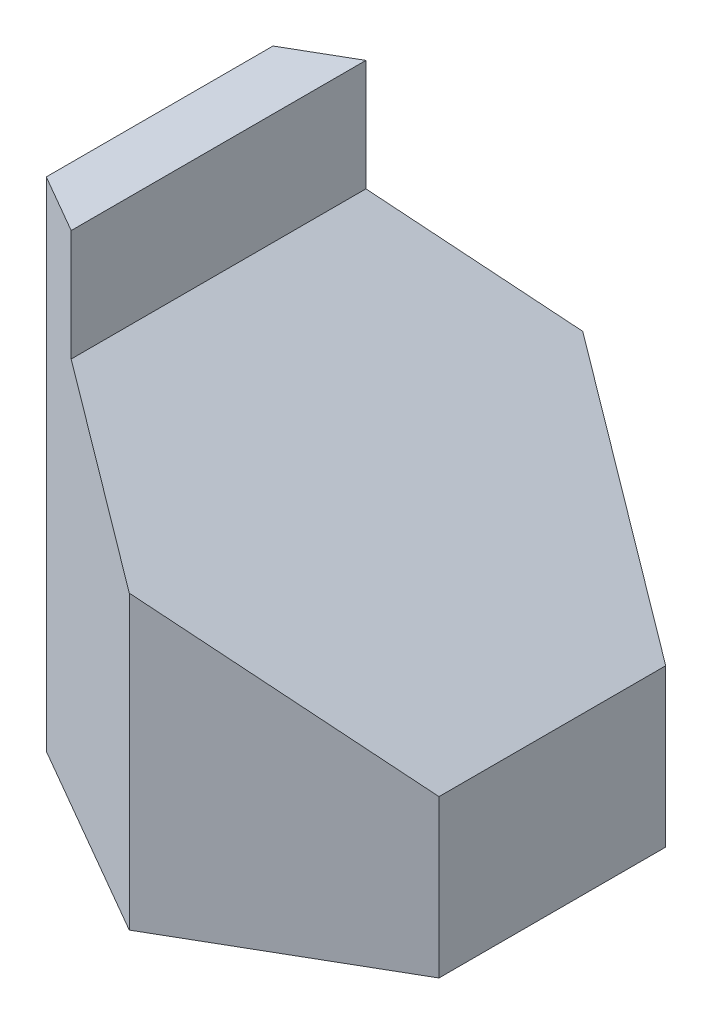
ISO-10303-21;
HEADER;
FILE_DESCRIPTION(('STEP AP214'),'2;1');
FILE_NAME('part.step','',(''),(''),'','','');
FILE_SCHEMA(('AUTOMOTIVE_DESIGN { 1 0 10303 214 1 1 1 1 }'));
ENDSEC;
DATA;
#1=APPLICATION_CONTEXT('core data for automotive mechanical design processes');
#2=APPLICATION_PROTOCOL_DEFINITION('international standard','automotive_design',2000,#1);
#3=PRODUCT_CONTEXT('',#1,'mechanical');
#4=PRODUCT('Part','Part','',(#3));
#5=PRODUCT_RELATED_PRODUCT_CATEGORY('part','',(#4));
#6=PRODUCT_DEFINITION_FORMATION('','',#4);
#7=PRODUCT_DEFINITION_CONTEXT('part definition',#1,'design');
#8=PRODUCT_DEFINITION('design','',#6,#7);
#9=PRODUCT_DEFINITION_SHAPE('','',#8);
#10=(LENGTH_UNIT() NAMED_UNIT(*) SI_UNIT(.MILLI.,.METRE.));
#11=(NAMED_UNIT(*) PLANE_ANGLE_UNIT() SI_UNIT($,.RADIAN.));
#12=(NAMED_UNIT(*) SI_UNIT($,.STERADIAN.) SOLID_ANGLE_UNIT());
#13=UNCERTAINTY_MEASURE_WITH_UNIT(LENGTH_MEASURE(1.E-05),#10,'distance_accuracy_value','');
#14=(GEOMETRIC_REPRESENTATION_CONTEXT(3) GLOBAL_UNCERTAINTY_ASSIGNED_CONTEXT((#13)) GLOBAL_UNIT_ASSIGNED_CONTEXT((#10,
#11,#12)) REPRESENTATION_CONTEXT('',''));
#15=CARTESIAN_POINT('',(0.,0.,0.));
#16=DIRECTION('',(0.,0.,1.));
#17=DIRECTION('',(1.,0.,0.));
#18=AXIS2_PLACEMENT_3D('',#15,#16,#17);
#19=CARTESIAN_POINT('',(30.,76.,-17.3205080756888));
#20=DIRECTION('',(-0.5,0.,0.866025403784439));
#21=DIRECTION('',(0.866025403784439,0.,0.5));
#22=AXIS2_PLACEMENT_3D('',#19,#20,#21);
#23=PLANE('',#22);
#24=DIRECTION('',(-0.744466052828597,0.510908075470606,-0.429817676003129));
#25=VECTOR('',#24,1.);
#26=CARTESIAN_POINT('',(10.2216066481994,37.5734072022161,-28.7395688014891));
#27=LINE('',#26,#25);
#28=CARTESIAN_POINT('',(30.,24.,-17.3205080756888));
#29=VERTEX_POINT('',#28);
#30=CARTESIAN_POINT('',(0.,44.5882352941176,-34.6410161513776));
#31=VERTEX_POINT('',#30);
#32=EDGE_CURVE('E90',#29,#31,#27,.T.);
#33=ORIENTED_EDGE('',*,*,#32,.F.);
#34=DIRECTION('',(0.,-1.,0.));
#35=VECTOR('',#34,1.);
#36=CARTESIAN_POINT('',(30.,76.,-17.3205080756888));
#37=LINE('',#36,#35);
#38=CARTESIAN_POINT('',(30.,0.,-17.3205080756888));
#39=VERTEX_POINT('',#38);
#40=EDGE_CURVE('E83',#29,#39,#37,.T.);
#41=ORIENTED_EDGE('',*,*,#40,.T.);
#42=DIRECTION('',(-0.866025403784439,0.,-0.5));
#43=VECTOR('',#42,1.);
#44=CARTESIAN_POINT('',(30.,0.,-17.3205080756888));
#45=LINE('',#44,#43);
#46=CARTESIAN_POINT('',(0.,0.,-34.6410161513776));
#47=VERTEX_POINT('',#46);
#48=EDGE_CURVE('E87',#39,#47,#45,.T.);
#49=ORIENTED_EDGE('',*,*,#48,.T.);
#50=DIRECTION('',(0.,-1.,0.));
#51=VECTOR('',#50,1.);
#52=CARTESIAN_POINT('',(0.,76.,-34.6410161513776));
#53=LINE('',#52,#51);
#54=EDGE_CURVE('E42',#31,#47,#53,.T.);
#55=ORIENTED_EDGE('',*,*,#54,.F.);
#56=EDGE_LOOP('',(#33,#41,#49,#55));
#57=FACE_BOUND('',#56,.T.);
#58=ADVANCED_FACE('F35',(#57),#23,.F.);
#59=CARTESIAN_POINT('',(0.,76.,-34.6410161513776));
#60=DIRECTION('',(0.5,0.,0.866025403784439));
#61=DIRECTION('',(0.866025403784438,0.,-0.5));
#62=AXIS2_PLACEMENT_3D('',#59,#60,#61);
#63=PLANE('',#62);
#64=DIRECTION('',(-0.744466052828597,0.510908075470606,0.429817676003129));
#65=VECTOR('',#64,1.);
#66=CARTESIAN_POINT('',(-11.9475815043682,52.7875559343703,-27.7430767536656));
#67=LINE('',#66,#65);
#68=CARTESIAN_POINT('',(-21.,59.,-22.5166604983954));
#69=VERTEX_POINT('',#68);
#70=EDGE_CURVE('E137',#31,#69,#67,.T.);
#71=ORIENTED_EDGE('',*,*,#70,.F.);
#72=ORIENTED_EDGE('',*,*,#54,.T.);
#73=DIRECTION('',(-0.866025403784439,0.,0.5));
#74=VECTOR('',#73,1.);
#75=CARTESIAN_POINT('',(0.,0.,-34.6410161513776));
#76=LINE('',#75,#74);
#77=CARTESIAN_POINT('',(-30.,0.,-17.3205080756888));
#78=VERTEX_POINT('',#77);
#79=EDGE_CURVE('E109',#47,#78,#76,.T.);
#80=ORIENTED_EDGE('',*,*,#79,.T.);
#81=DIRECTION('',(0.,-1.,0.));
#82=VECTOR('',#81,1.);
#83=CARTESIAN_POINT('',(-30.,76.,-17.3205080756888));
#84=LINE('',#83,#82);
#85=CARTESIAN_POINT('',(-30.,76.,-17.3205080756888));
#86=VERTEX_POINT('',#85);
#87=EDGE_CURVE('E129',#86,#78,#84,.T.);
#88=ORIENTED_EDGE('',*,*,#87,.F.);
#89=DIRECTION('',(-0.866025403784439,0.,0.5));
#90=VECTOR('',#89,1.);
#91=CARTESIAN_POINT('',(0.,76.,-34.6410161513776));
#92=LINE('',#91,#90);
#93=CARTESIAN_POINT('',(-21.,76.,-22.5166604983954));
#94=VERTEX_POINT('',#93);
#95=EDGE_CURVE('E103',#94,#86,#92,.T.);
#96=ORIENTED_EDGE('',*,*,#95,.F.);
#97=DIRECTION('',(0.,1.,0.));
#98=VECTOR('',#97,1.);
#99=CARTESIAN_POINT('',(-21.,76.,-22.5166604983954));
#100=LINE('',#99,#98);
#101=EDGE_CURVE('E49',#69,#94,#100,.T.);
#102=ORIENTED_EDGE('',*,*,#101,.F.);
#103=EDGE_LOOP('',(#71,#72,#80,#88,#96,#102));
#104=FACE_BOUND('',#103,.T.);
#105=ADVANCED_FACE('F133',(#104),#63,.F.);
#106=CARTESIAN_POINT('',(-30.,76.,17.3205080756888));
#107=DIRECTION('',(0.5,0.,-0.866025403784439));
#108=DIRECTION('',(-0.866025403784439,0.,-0.5));
#109=AXIS2_PLACEMENT_3D('',#106,#107,#108);
#110=PLANE('',#109);
#111=DIRECTION('',(0.744466052828597,-0.510908075470606,0.429817676003129));
#112=VECTOR('',#111,1.);
#113=CARTESIAN_POINT('',(-34.1167696569359,68.0017046665246,14.9436900060652));
#114=LINE('',#113,#112);
#115=CARTESIAN_POINT('',(-21.,59.,22.5166604983954));
#116=VERTEX_POINT('',#115);
#117=CARTESIAN_POINT('',(0.,44.5882352941176,34.6410161513775));
#118=VERTEX_POINT('',#117);
#119=EDGE_CURVE('E162',#116,#118,#114,.T.);
#120=ORIENTED_EDGE('',*,*,#119,.F.);
#121=DIRECTION('',(0.,-1.,0.));
#122=VECTOR('',#121,1.);
#123=CARTESIAN_POINT('',(-21.,76.,22.5166604983954));
#124=LINE('',#123,#122);
#125=CARTESIAN_POINT('',(-21.,76.,22.5166604983954));
#126=VERTEX_POINT('',#125);
#127=EDGE_CURVE('E113',#126,#116,#124,.T.);
#128=ORIENTED_EDGE('',*,*,#127,.F.);
#129=DIRECTION('',(0.866025403784439,0.,0.5));
#130=VECTOR('',#129,1.);
#131=CARTESIAN_POINT('',(-30.,76.,17.3205080756888));
#132=LINE('',#131,#130);
#133=CARTESIAN_POINT('',(-30.,76.,17.3205080756888));
#134=VERTEX_POINT('',#133);
#135=EDGE_CURVE('E94',#134,#126,#132,.T.);
#136=ORIENTED_EDGE('',*,*,#135,.F.);
#137=DIRECTION('',(0.,-1.,0.));
#138=VECTOR('',#137,1.);
#139=CARTESIAN_POINT('',(-30.,76.,17.3205080756888));
#140=LINE('',#139,#138);
#141=CARTESIAN_POINT('',(-30.,0.,17.3205080756888));
#142=VERTEX_POINT('',#141);
#143=EDGE_CURVE('E126',#134,#142,#140,.T.);
#144=ORIENTED_EDGE('',*,*,#143,.T.);
#145=DIRECTION('',(0.866025403784439,0.,0.5));
#146=VECTOR('',#145,1.);
#147=CARTESIAN_POINT('',(-30.,0.,17.3205080756888));
#148=LINE('',#147,#146);
#149=CARTESIAN_POINT('',(0.,0.,34.6410161513776));
#150=VERTEX_POINT('',#149);
#151=EDGE_CURVE('E119',#142,#150,#148,.T.);
#152=ORIENTED_EDGE('',*,*,#151,.T.);
#153=DIRECTION('',(0.,-1.,0.));
#154=VECTOR('',#153,1.);
#155=CARTESIAN_POINT('',(0.,76.,34.6410161513776));
#156=LINE('',#155,#154);
#157=EDGE_CURVE('E124',#118,#150,#156,.T.);
#158=ORIENTED_EDGE('',*,*,#157,.F.);
#159=EDGE_LOOP('',(#120,#128,#136,#144,#152,#158));
#160=FACE_BOUND('',#159,.T.);
#161=ADVANCED_FACE('F176',(#160),#110,.F.);
#162=CARTESIAN_POINT('',(0.,76.,34.6410161513776));
#163=DIRECTION('',(-0.5,0.,-0.866025403784438));
#164=DIRECTION('',(-0.866025403784438,0.,0.5));
#165=AXIS2_PLACEMENT_3D('',#162,#163,#164);
#166=PLANE('',#165);
#167=DIRECTION('',(0.744466052828597,-0.510908075470606,-0.429817676003129));
#168=VECTOR('',#167,1.);
#169=CARTESIAN_POINT('',(-11.9475815043682,52.7875559343703,41.5389555490895));
#170=LINE('',#169,#168);
#171=CARTESIAN_POINT('',(30.,24.,17.3205080756888));
#172=VERTEX_POINT('',#171);
#173=EDGE_CURVE('E164',#118,#172,#170,.T.);
#174=ORIENTED_EDGE('',*,*,#173,.F.);
#175=ORIENTED_EDGE('',*,*,#157,.T.);
#176=DIRECTION('',(0.866025403784438,0.,-0.5));
#177=VECTOR('',#176,1.);
#178=CARTESIAN_POINT('',(0.,0.,34.6410161513776));
#179=LINE('',#178,#177);
#180=CARTESIAN_POINT('',(30.,0.,17.3205080756888));
#181=VERTEX_POINT('',#180);
#182=EDGE_CURVE('E104',#150,#181,#179,.T.);
#183=ORIENTED_EDGE('',*,*,#182,.T.);
#184=DIRECTION('',(0.,-1.,0.));
#185=VECTOR('',#184,1.);
#186=CARTESIAN_POINT('',(30.,76.,17.3205080756888));
#187=LINE('',#186,#185);
#188=EDGE_CURVE('E93',#172,#181,#187,.T.);
#189=ORIENTED_EDGE('',*,*,#188,.F.);
#190=EDGE_LOOP('',(#174,#175,#183,#189));
#191=FACE_BOUND('',#190,.T.);
#192=ADVANCED_FACE('F172',(#191),#166,.F.);
#193=CARTESIAN_POINT('',(30.,76.,17.3205080756888));
#194=DIRECTION('',(-1.,0.,0.));
#195=DIRECTION('',(0.,0.,1.));
#196=AXIS2_PLACEMENT_3D('',#193,#194,#195);
#197=PLANE('',#196);
#198=DIRECTION('',(0.,0.,-1.));
#199=VECTOR('',#198,1.);
#200=CARTESIAN_POINT('',(30.,24.,17.3205080756888));
#201=LINE('',#200,#199);
#202=EDGE_CURVE('E167',#172,#29,#201,.T.);
#203=ORIENTED_EDGE('',*,*,#202,.F.);
#204=ORIENTED_EDGE('',*,*,#188,.T.);
#205=DIRECTION('',(0.,0.,-1.));
#206=VECTOR('',#205,1.);
#207=CARTESIAN_POINT('',(30.,0.,17.3205080756888));
#208=LINE('',#207,#206);
#209=EDGE_CURVE('E97',#181,#39,#208,.T.);
#210=ORIENTED_EDGE('',*,*,#209,.T.);
#211=ORIENTED_EDGE('',*,*,#40,.F.);
#212=EDGE_LOOP('',(#203,#204,#210,#211));
#213=FACE_BOUND('',#212,.T.);
#214=ADVANCED_FACE('F98',(#213),#197,.F.);
#215=CARTESIAN_POINT('',(0.,76.,0.));
#216=DIRECTION('',(0.,1.,0.));
#217=DIRECTION('',(0.,0.,1.));
#218=AXIS2_PLACEMENT_3D('',#215,#216,#217);
#219=PLANE('',#218);
#220=ORIENTED_EDGE('',*,*,#135,.T.);
#221=DIRECTION('',(0.,0.,-1.));
#222=VECTOR('',#221,1.);
#223=CARTESIAN_POINT('',(-21.,76.,0.));
#224=LINE('',#223,#222);
#225=EDGE_CURVE('E11',#126,#94,#224,.T.);
#226=ORIENTED_EDGE('',*,*,#225,.T.);
#227=ORIENTED_EDGE('',*,*,#95,.T.);
#228=DIRECTION('',(0.,0.,1.));
#229=VECTOR('',#228,1.);
#230=CARTESIAN_POINT('',(-30.,76.,-17.3205080756888));
#231=LINE('',#230,#229);
#232=EDGE_CURVE('E57',#86,#134,#231,.T.);
#233=ORIENTED_EDGE('',*,*,#232,.T.);
#234=EDGE_LOOP('',(#220,#226,#227,#233));
#235=FACE_BOUND('',#234,.T.);
#236=ADVANCED_FACE('F181',(#235),#219,.T.);
#237=CARTESIAN_POINT('',(-30.,76.,-17.3205080756888));
#238=DIRECTION('',(1.,0.,0.));
#239=DIRECTION('',(0.,0.,-1.));
#240=AXIS2_PLACEMENT_3D('',#237,#238,#239);
#241=PLANE('',#240);
#242=DIRECTION('',(0.,0.,1.));
#243=VECTOR('',#242,1.);
#244=CARTESIAN_POINT('',(-30.,0.,-17.3205080756888));
#245=LINE('',#244,#243);
#246=EDGE_CURVE('E111',#78,#142,#245,.T.);
#247=ORIENTED_EDGE('',*,*,#246,.T.);
#248=ORIENTED_EDGE('',*,*,#143,.F.);
#249=ORIENTED_EDGE('',*,*,#232,.F.);
#250=ORIENTED_EDGE('',*,*,#87,.T.);
#251=EDGE_LOOP('',(#247,#248,#249,#250));
#252=FACE_BOUND('',#251,.T.);
#253=ADVANCED_FACE('F179',(#252),#241,.F.);
#254=CARTESIAN_POINT('',(0.,0.,0.));
#255=DIRECTION('',(0.,1.,0.));
#256=DIRECTION('',(0.,0.,1.));
#257=AXIS2_PLACEMENT_3D('',#254,#255,#256);
#258=PLANE('',#257);
#259=ORIENTED_EDGE('',*,*,#48,.F.);
#260=ORIENTED_EDGE('',*,*,#209,.F.);
#261=ORIENTED_EDGE('',*,*,#182,.F.);
#262=ORIENTED_EDGE('',*,*,#151,.F.);
#263=ORIENTED_EDGE('',*,*,#246,.F.);
#264=ORIENTED_EDGE('',*,*,#79,.F.);
#265=EDGE_LOOP('',(#259,#260,#261,#262,#263,#264));
#266=FACE_BOUND('',#265,.T.);
#267=ADVANCED_FACE('F107',(#266),#258,.F.);
#268=CARTESIAN_POINT('',(-21.,0.,0.));
#269=DIRECTION('',(1.,0.,0.));
#270=DIRECTION('',(0.,0.,-1.));
#271=AXIS2_PLACEMENT_3D('',#268,#269,#270);
#272=PLANE('',#271);
#273=ORIENTED_EDGE('',*,*,#101,.T.);
#274=ORIENTED_EDGE('',*,*,#225,.F.);
#275=ORIENTED_EDGE('',*,*,#127,.T.);
#276=DIRECTION('',(0.,0.,-1.));
#277=VECTOR('',#276,1.);
#278=CARTESIAN_POINT('',(-21.,59.,34.6410161513776));
#279=LINE('',#278,#277);
#280=EDGE_CURVE('E150',#116,#69,#279,.T.);
#281=ORIENTED_EDGE('',*,*,#280,.T.);
#282=EDGE_LOOP('',(#273,#274,#275,#281));
#283=FACE_BOUND('',#282,.T.);
#284=ADVANCED_FACE('F154',(#283),#272,.T.);
#285=CARTESIAN_POINT('',(20.8024046001045,30.3120752744381,0.));
#286=DIRECTION('',(0.565842496912414,0.824513352643803,0.));
#287=DIRECTION('',(-0.824513352643803,0.565842496912414,0.));
#288=AXIS2_PLACEMENT_3D('',#285,#286,#287);
#289=PLANE('',#288);
#290=ORIENTED_EDGE('',*,*,#70,.T.);
#291=ORIENTED_EDGE('',*,*,#280,.F.);
#292=ORIENTED_EDGE('',*,*,#119,.T.);
#293=ORIENTED_EDGE('',*,*,#173,.T.);
#294=ORIENTED_EDGE('',*,*,#202,.T.);
#295=ORIENTED_EDGE('',*,*,#32,.T.);
#296=EDGE_LOOP('',(#290,#291,#292,#293,#294,#295));
#297=FACE_BOUND('',#296,.T.);
#298=ADVANCED_FACE('F148',(#297),#289,.T.);
#299=CLOSED_SHELL('',(#58,#105,#161,#192,#214,#236,#253,#267,#284,#298));
#300=MANIFOLD_SOLID_BREP('B2',#299);
#301=ADVANCED_BREP_SHAPE_REPRESENTATION('',(#18,#300),#14);
#302=SHAPE_DEFINITION_REPRESENTATION(#9,#301);
ENDSEC;
END-ISO-10303-21;
